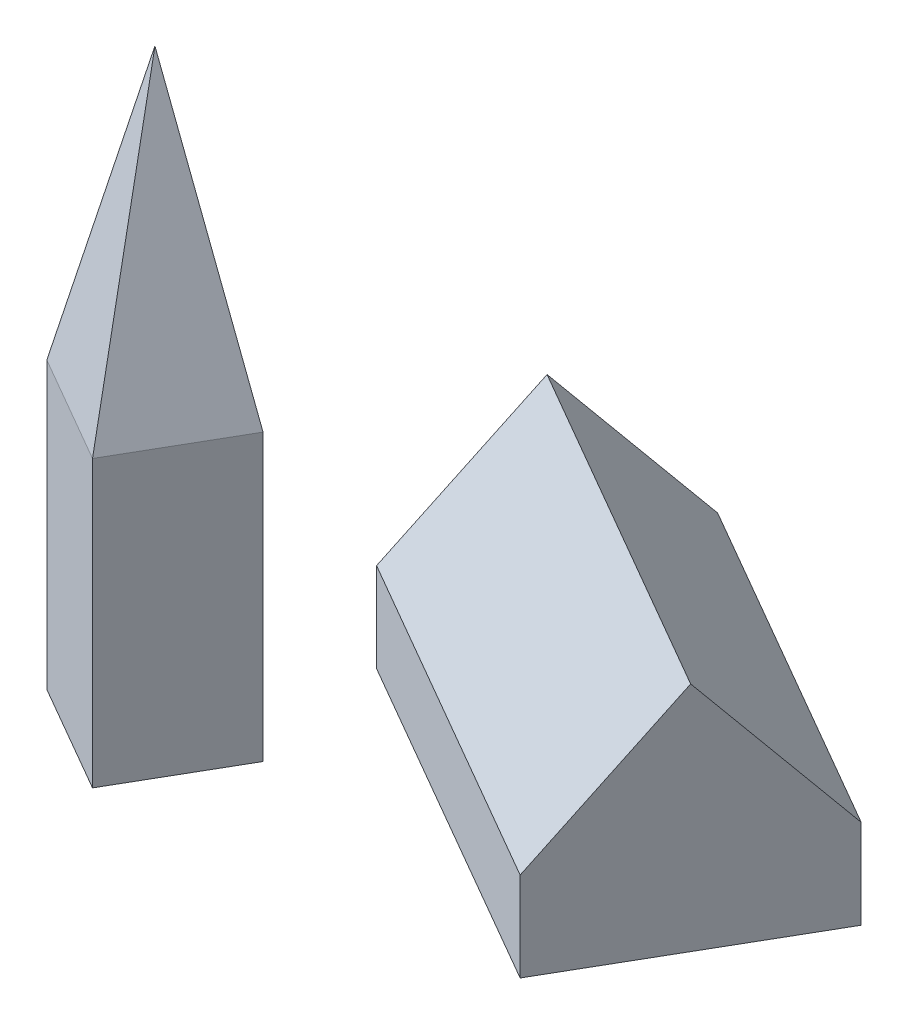
ISO-10303-21;
HEADER;
FILE_DESCRIPTION(('STEP AP214'),'2;1');
FILE_NAME('part.step','',(''),(''),'','','');
FILE_SCHEMA(('AUTOMOTIVE_DESIGN { 1 0 10303 214 1 1 1 1 }'));
ENDSEC;
DATA;
#1=APPLICATION_CONTEXT('core data for automotive mechanical design processes');
#2=APPLICATION_PROTOCOL_DEFINITION('international standard','automotive_design',2000,#1);
#3=PRODUCT_CONTEXT('',#1,'mechanical');
#4=PRODUCT('Part','Part','',(#3));
#5=PRODUCT_RELATED_PRODUCT_CATEGORY('part','',(#4));
#6=PRODUCT_DEFINITION_FORMATION('','',#4);
#7=PRODUCT_DEFINITION_CONTEXT('part definition',#1,'design');
#8=PRODUCT_DEFINITION('design','',#6,#7);
#9=PRODUCT_DEFINITION_SHAPE('','',#8);
#10=(LENGTH_UNIT() NAMED_UNIT(*) SI_UNIT(.MILLI.,.METRE.));
#11=(NAMED_UNIT(*) PLANE_ANGLE_UNIT() SI_UNIT($,.RADIAN.));
#12=(NAMED_UNIT(*) SI_UNIT($,.STERADIAN.) SOLID_ANGLE_UNIT());
#13=UNCERTAINTY_MEASURE_WITH_UNIT(LENGTH_MEASURE(1.E-05),#10,'distance_accuracy_value','');
#14=(GEOMETRIC_REPRESENTATION_CONTEXT(3) GLOBAL_UNCERTAINTY_ASSIGNED_CONTEXT((#13)) GLOBAL_UNIT_ASSIGNED_CONTEXT((#10,
#11,#12)) REPRESENTATION_CONTEXT('',''));
#15=CARTESIAN_POINT('',(0.,0.,0.));
#16=DIRECTION('',(0.,0.,1.));
#17=DIRECTION('',(1.,0.,0.));
#18=AXIS2_PLACEMENT_3D('',#15,#16,#17);
#19=CARTESIAN_POINT('',(-76.1602540378445,80.,111.913429510899));
#20=DIRECTION('',(0.866025403784439,0.,0.5));
#21=DIRECTION('',(0.5,0.,-0.866025403784439));
#22=AXIS2_PLACEMENT_3D('',#19,#20,#21);
#23=PLANE('',#22);
#24=DIRECTION('',(-0.5,0.,0.866025403784439));
#25=VECTOR('',#24,1.);
#26=CARTESIAN_POINT('',(-76.1602540378445,0.,111.913429510899));
#27=LINE('',#26,#25);
#28=CARTESIAN_POINT('',(-58.6602540378445,0.,81.6025403784438));
#29=VERTEX_POINT('',#28);
#30=CARTESIAN_POINT('',(-76.1602540378445,0.,111.913429510899));
#31=VERTEX_POINT('',#30);
#32=EDGE_CURVE('E121',#29,#31,#27,.T.);
#33=ORIENTED_EDGE('',*,*,#32,.T.);
#34=DIRECTION('',(0.,-1.,0.));
#35=VECTOR('',#34,1.);
#36=CARTESIAN_POINT('',(-76.1602540378445,80.,111.913429510899));
#37=LINE('',#36,#35);
#38=CARTESIAN_POINT('',(-76.1602540378445,80.,111.913429510899));
#39=VERTEX_POINT('',#38);
#40=EDGE_CURVE('E13',#39,#31,#37,.T.);
#41=ORIENTED_EDGE('',*,*,#40,.F.);
#42=DIRECTION('',(-0.5,0.,0.866025403784439));
#43=VECTOR('',#42,1.);
#44=CARTESIAN_POINT('',(-58.6602540378445,80.,81.6025403784438));
#45=LINE('',#44,#43);
#46=CARTESIAN_POINT('',(-58.6602540378445,80.0000000000001,81.6025403784438));
#47=VERTEX_POINT('',#46);
#48=EDGE_CURVE('E99',#47,#39,#45,.T.);
#49=ORIENTED_EDGE('',*,*,#48,.F.);
#50=DIRECTION('',(0.,-1.,0.));
#51=VECTOR('',#50,1.);
#52=CARTESIAN_POINT('',(-58.6602540378445,80.,81.6025403784438));
#53=LINE('',#52,#51);
#54=EDGE_CURVE('E101',#47,#29,#53,.T.);
#55=ORIENTED_EDGE('',*,*,#54,.T.);
#56=EDGE_LOOP('',(#33,#41,#49,#55));
#57=FACE_BOUND('',#56,.T.);
#58=ADVANCED_FACE('F44',(#57),#23,.F.);
#59=CARTESIAN_POINT('',(-45.8493649053892,80.,129.413429510899));
#60=DIRECTION('',(0.499999999999999,0.,-0.866025403784439));
#61=DIRECTION('',(-0.866025403784439,0.,-0.499999999999999));
#62=AXIS2_PLACEMENT_3D('',#59,#60,#61);
#63=PLANE('',#62);
#64=DIRECTION('',(0.866025403784439,0.,0.499999999999999));
#65=VECTOR('',#64,1.);
#66=CARTESIAN_POINT('',(-45.8493649053892,0.,129.413429510899));
#67=LINE('',#66,#65);
#68=CARTESIAN_POINT('',(-45.8493649053892,0.,129.413429510899));
#69=VERTEX_POINT('',#68);
#70=EDGE_CURVE('E128',#31,#69,#67,.T.);
#71=ORIENTED_EDGE('',*,*,#70,.T.);
#72=DIRECTION('',(0.,-1.,0.));
#73=VECTOR('',#72,1.);
#74=CARTESIAN_POINT('',(-45.8493649053892,80.,129.413429510899));
#75=LINE('',#74,#73);
#76=CARTESIAN_POINT('',(-45.8493649053892,80.0000000000001,129.413429510899));
#77=VERTEX_POINT('',#76);
#78=EDGE_CURVE('E53',#77,#69,#75,.T.);
#79=ORIENTED_EDGE('',*,*,#78,.F.);
#80=DIRECTION('',(0.866025403784439,0.,0.499999999999999));
#81=VECTOR('',#80,1.);
#82=CARTESIAN_POINT('',(-76.1602540378445,80.,111.913429510899));
#83=LINE('',#82,#81);
#84=EDGE_CURVE('E47',#39,#77,#83,.T.);
#85=ORIENTED_EDGE('',*,*,#84,.F.);
#86=ORIENTED_EDGE('',*,*,#40,.T.);
#87=EDGE_LOOP('',(#71,#79,#85,#86));
#88=FACE_BOUND('',#87,.T.);
#89=ADVANCED_FACE('F149',(#88),#63,.F.);
#90=CARTESIAN_POINT('',(-28.3493649053892,80.,99.1025403784438));
#91=DIRECTION('',(-0.866025403784439,0.,-0.5));
#92=DIRECTION('',(-0.5,0.,0.866025403784439));
#93=AXIS2_PLACEMENT_3D('',#90,#91,#92);
#94=PLANE('',#93);
#95=DIRECTION('',(0.5,0.,-0.866025403784439));
#96=VECTOR('',#95,1.);
#97=CARTESIAN_POINT('',(-28.3493649053892,0.,99.1025403784438));
#98=LINE('',#97,#96);
#99=CARTESIAN_POINT('',(-28.3493649053892,0.,99.1025403784438));
#100=VERTEX_POINT('',#99);
#101=EDGE_CURVE('E130',#69,#100,#98,.T.);
#102=ORIENTED_EDGE('',*,*,#101,.T.);
#103=DIRECTION('',(0.,-1.,0.));
#104=VECTOR('',#103,1.);
#105=CARTESIAN_POINT('',(-28.3493649053892,80.,99.1025403784438));
#106=LINE('',#105,#104);
#107=CARTESIAN_POINT('',(-28.3493649053892,80.0000000000002,99.1025403784438));
#108=VERTEX_POINT('',#107);
#109=EDGE_CURVE('E61',#108,#100,#106,.T.);
#110=ORIENTED_EDGE('',*,*,#109,.F.);
#111=DIRECTION('',(0.5,0.,-0.866025403784439));
#112=VECTOR('',#111,1.);
#113=CARTESIAN_POINT('',(-45.8493649053892,80.,129.413429510899));
#114=LINE('',#113,#112);
#115=EDGE_CURVE('E115',#77,#108,#114,.T.);
#116=ORIENTED_EDGE('',*,*,#115,.F.);
#117=ORIENTED_EDGE('',*,*,#78,.T.);
#118=EDGE_LOOP('',(#102,#110,#116,#117));
#119=FACE_BOUND('',#118,.T.);
#120=ADVANCED_FACE('F153',(#119),#94,.F.);
#121=CARTESIAN_POINT('',(-58.6602540378445,80.,81.6025403784438));
#122=DIRECTION('',(-0.5,0.,0.866025403784438));
#123=DIRECTION('',(0.866025403784438,0.,0.5));
#124=AXIS2_PLACEMENT_3D('',#121,#122,#123);
#125=PLANE('',#124);
#126=DIRECTION('',(-0.866025403784438,0.,-0.5));
#127=VECTOR('',#126,1.);
#128=CARTESIAN_POINT('',(-58.6602540378445,0.,81.6025403784438));
#129=LINE('',#128,#127);
#130=EDGE_CURVE('E78',#100,#29,#129,.T.);
#131=ORIENTED_EDGE('',*,*,#130,.T.);
#132=ORIENTED_EDGE('',*,*,#54,.F.);
#133=DIRECTION('',(-0.866025403784438,0.,-0.5));
#134=VECTOR('',#133,1.);
#135=CARTESIAN_POINT('',(-28.3493649053892,80.,99.1025403784438));
#136=LINE('',#135,#134);
#137=EDGE_CURVE('E110',#108,#47,#136,.T.);
#138=ORIENTED_EDGE('',*,*,#137,.F.);
#139=ORIENTED_EDGE('',*,*,#109,.T.);
#140=EDGE_LOOP('',(#131,#132,#138,#139));
#141=FACE_BOUND('',#140,.T.);
#142=ADVANCED_FACE('F109',(#141),#125,.F.);
#143=CARTESIAN_POINT('',(-58.6602540378445,0.,81.6025403784438));
#144=DIRECTION('',(0.,-1.,0.));
#145=DIRECTION('',(0.,0.,-1.));
#146=AXIS2_PLACEMENT_3D('',#143,#144,#145);
#147=PLANE('',#146);
#148=ORIENTED_EDGE('',*,*,#32,.F.);
#149=ORIENTED_EDGE('',*,*,#130,.F.);
#150=ORIENTED_EDGE('',*,*,#101,.F.);
#151=ORIENTED_EDGE('',*,*,#70,.F.);
#152=EDGE_LOOP('',(#148,#149,#150,#151));
#153=FACE_BOUND('',#152,.T.);
#154=ADVANCED_FACE('F140',(#153),#147,.T.);
#155=CARTESIAN_POINT('',(-58.6602540378445,80.,81.6025403784438));
#156=DIRECTION('',(-0.848234681375854,0.201652920670487,-0.489728521628326));
#157=DIRECTION('',(-0.5,0.,0.866025403784439));
#158=AXIS2_PLACEMENT_3D('',#155,#156,#157);
#159=PLANE('',#158);
#160=DIRECTION('',(-0.0723536592387232,-0.960130241032339,-0.27002753239244));
#161=VECTOR('',#160,1.);
#162=CARTESIAN_POINT('',(-52.2548094716168,165.,105.507984944671));
#163=LINE('',#162,#161);
#164=CARTESIAN_POINT('',(-52.2548094716168,165.,105.507984944671));
#165=VERTEX_POINT('',#164);
#166=EDGE_CURVE('E114',#165,#47,#163,.T.);
#167=ORIENTED_EDGE('',*,*,#166,.T.);
#168=ORIENTED_EDGE('',*,*,#48,.T.);
#169=DIRECTION('',(-0.27002753239244,-0.960130241032339,0.0723536592387233));
#170=VECTOR('',#169,1.);
#171=CARTESIAN_POINT('',(-52.2548094716168,165.,105.507984944671));
#172=LINE('',#171,#170);
#173=EDGE_CURVE('E118',#165,#39,#172,.T.);
#174=ORIENTED_EDGE('',*,*,#173,.F.);
#175=EDGE_LOOP('',(#167,#168,#174));
#176=FACE_BOUND('',#175,.T.);
#177=ADVANCED_FACE('F117',(#176),#159,.T.);
#178=CARTESIAN_POINT('',(-76.1602540378445,80.,111.913429510899));
#179=DIRECTION('',(-0.489728521628325,0.201652920670487,0.848234681375855));
#180=DIRECTION('',(0.866025403784439,0.,0.499999999999999));
#181=AXIS2_PLACEMENT_3D('',#178,#179,#180);
#182=PLANE('',#181);
#183=ORIENTED_EDGE('',*,*,#173,.T.);
#184=ORIENTED_EDGE('',*,*,#84,.T.);
#185=DIRECTION('',(0.0723536592387231,-0.960130241032339,0.27002753239244));
#186=VECTOR('',#185,1.);
#187=CARTESIAN_POINT('',(-52.2548094716168,165.,105.507984944671));
#188=LINE('',#187,#186);
#189=EDGE_CURVE('E123',#165,#77,#188,.T.);
#190=ORIENTED_EDGE('',*,*,#189,.F.);
#191=EDGE_LOOP('',(#183,#184,#190));
#192=FACE_BOUND('',#191,.T.);
#193=ADVANCED_FACE('F136',(#192),#182,.T.);
#194=CARTESIAN_POINT('',(-28.3493649053892,80.,99.1025403784438));
#195=DIRECTION('',(0.489728521628326,0.201652920670487,-0.848234681375854));
#196=DIRECTION('',(-0.866025403784438,0.,-0.5));
#197=AXIS2_PLACEMENT_3D('',#194,#195,#196);
#198=PLANE('',#197);
#199=DIRECTION('',(0.27002753239244,-0.960130241032339,-0.0723536592387227));
#200=VECTOR('',#199,1.);
#201=CARTESIAN_POINT('',(-52.2548094716168,165.,105.507984944671));
#202=LINE('',#201,#200);
#203=EDGE_CURVE('E94',#165,#108,#202,.T.);
#204=ORIENTED_EDGE('',*,*,#203,.T.);
#205=ORIENTED_EDGE('',*,*,#137,.T.);
#206=ORIENTED_EDGE('',*,*,#166,.F.);
#207=EDGE_LOOP('',(#204,#205,#206));
#208=FACE_BOUND('',#207,.T.);
#209=ADVANCED_FACE('F113',(#208),#198,.T.);
#210=CARTESIAN_POINT('',(-45.8493649053892,80.,129.413429510899));
#211=DIRECTION('',(0.848234681375854,0.201652920670487,0.489728521628326));
#212=DIRECTION('',(0.5,0.,-0.866025403784439));
#213=AXIS2_PLACEMENT_3D('',#210,#211,#212);
#214=PLANE('',#213);
#215=ORIENTED_EDGE('',*,*,#189,.T.);
#216=ORIENTED_EDGE('',*,*,#115,.T.);
#217=ORIENTED_EDGE('',*,*,#203,.F.);
#218=EDGE_LOOP('',(#215,#216,#217));
#219=FACE_BOUND('',#218,.T.);
#220=ADVANCED_FACE('F137',(#219),#214,.T.);
#221=CLOSED_SHELL('',(#58,#89,#120,#142,#154,#177,#193,#209,#220));
#222=MANIFOLD_SOLID_BREP('B2',#221);
#223=CARTESIAN_POINT('',(-35.0000000000003,25.,60.6217782649106));
#224=DIRECTION('',(0.866025403784436,0.,0.500000000000004));
#225=DIRECTION('',(0.500000000000004,0.,-0.866025403784436));
#226=AXIS2_PLACEMENT_3D('',#223,#224,#225);
#227=PLANE('',#226);
#228=DIRECTION('',(-0.500000000000004,0.,0.866025403784436));
#229=VECTOR('',#228,1.);
#230=CARTESIAN_POINT('',(-35.0000000000003,0.,60.6217782649106));
#231=LINE('',#230,#229);
#232=CARTESIAN_POINT('',(0.,0.,0.));
#233=VERTEX_POINT('',#232);
#234=CARTESIAN_POINT('',(-35.0000000000003,0.,60.6217782649106));
#235=VERTEX_POINT('',#234);
#236=EDGE_CURVE('E271',#233,#235,#231,.T.);
#237=ORIENTED_EDGE('',*,*,#236,.T.);
#238=DIRECTION('',(0.,-1.,0.));
#239=VECTOR('',#238,1.);
#240=CARTESIAN_POINT('',(-35.0000000000003,25.,60.6217782649106));
#241=LINE('',#240,#239);
#242=CARTESIAN_POINT('',(-35.0000000000003,25.,60.6217782649106));
#243=VERTEX_POINT('',#242);
#244=EDGE_CURVE('E42',#243,#235,#241,.T.);
#245=ORIENTED_EDGE('',*,*,#244,.F.);
#246=DIRECTION('',(-0.329252303934262,-0.752576694706878,0.570281718923245));
#247=VECTOR('',#246,1.);
#248=CARTESIAN_POINT('',(-17.5000000000001,65.,30.3108891324553));
#249=LINE('',#248,#247);
#250=CARTESIAN_POINT('',(-17.5000000000001,65.,30.3108891324553));
#251=VERTEX_POINT('',#250);
#252=EDGE_CURVE('E279',#251,#243,#249,.T.);
#253=ORIENTED_EDGE('',*,*,#252,.F.);
#254=DIRECTION('',(-0.329252303934261,0.752576694706878,0.570281718923245));
#255=VECTOR('',#254,1.);
#256=CARTESIAN_POINT('',(0.,25.,0.));
#257=LINE('',#256,#255);
#258=CARTESIAN_POINT('',(0.,25.,0.));
#259=VERTEX_POINT('',#258);
#260=EDGE_CURVE('E267',#259,#251,#257,.T.);
#261=ORIENTED_EDGE('',*,*,#260,.F.);
#262=DIRECTION('',(0.,-1.,0.));
#263=VECTOR('',#262,1.);
#264=CARTESIAN_POINT('',(0.,25.,0.));
#265=LINE('',#264,#263);
#266=EDGE_CURVE('E295',#259,#233,#265,.T.);
#267=ORIENTED_EDGE('',*,*,#266,.T.);
#268=EDGE_LOOP('',(#237,#245,#253,#261,#267));
#269=FACE_BOUND('',#268,.T.);
#270=ADVANCED_FACE('F215',(#269),#227,.F.);
#271=CARTESIAN_POINT('',(60.2627944162877,25.,115.621778264911));
#272=DIRECTION('',(0.500000000000004,0.,-0.866025403784436));
#273=DIRECTION('',(-0.866025403784436,0.,-0.500000000000004));
#274=AXIS2_PLACEMENT_3D('',#271,#272,#273);
#275=PLANE('',#274);
#276=DIRECTION('',(0.866025403784436,0.,0.500000000000004));
#277=VECTOR('',#276,1.);
#278=CARTESIAN_POINT('',(60.2627944162877,0.,115.621778264911));
#279=LINE('',#278,#277);
#280=CARTESIAN_POINT('',(60.2627944162877,0.,115.621778264911));
#281=VERTEX_POINT('',#280);
#282=EDGE_CURVE('E286',#235,#281,#279,.T.);
#283=ORIENTED_EDGE('',*,*,#282,.T.);
#284=DIRECTION('',(0.,-1.,0.));
#285=VECTOR('',#284,1.);
#286=CARTESIAN_POINT('',(60.2627944162877,25.,115.621778264911));
#287=LINE('',#286,#285);
#288=CARTESIAN_POINT('',(60.2627944162877,25.,115.621778264911));
#289=VERTEX_POINT('',#288);
#290=EDGE_CURVE('E222',#289,#281,#287,.T.);
#291=ORIENTED_EDGE('',*,*,#290,.F.);
#292=DIRECTION('',(0.866025403784436,0.,0.500000000000004));
#293=VECTOR('',#292,1.);
#294=CARTESIAN_POINT('',(60.2627944162877,25.,115.621778264911));
#295=LINE('',#294,#293);
#296=EDGE_CURVE('E276',#243,#289,#295,.T.);
#297=ORIENTED_EDGE('',*,*,#296,.F.);
#298=ORIENTED_EDGE('',*,*,#244,.T.);
#299=EDGE_LOOP('',(#283,#291,#297,#298));
#300=FACE_BOUND('',#299,.T.);
#301=ADVANCED_FACE('F307',(#300),#275,.F.);
#302=CARTESIAN_POINT('',(95.262794416288,25.,55.0000000000004));
#303=DIRECTION('',(-0.866025403784436,0.,-0.500000000000004));
#304=DIRECTION('',(-0.500000000000004,0.,0.866025403784436));
#305=AXIS2_PLACEMENT_3D('',#302,#303,#304);
#306=PLANE('',#305);
#307=DIRECTION('',(0.500000000000004,0.,-0.866025403784436));
#308=VECTOR('',#307,1.);
#309=CARTESIAN_POINT('',(95.262794416288,0.,55.0000000000004));
#310=LINE('',#309,#308);
#311=CARTESIAN_POINT('',(95.262794416288,0.,55.0000000000004));
#312=VERTEX_POINT('',#311);
#313=EDGE_CURVE('E288',#281,#312,#310,.T.);
#314=ORIENTED_EDGE('',*,*,#313,.T.);
#315=DIRECTION('',(0.,-1.,0.));
#316=VECTOR('',#315,1.);
#317=CARTESIAN_POINT('',(95.262794416288,25.,55.0000000000004));
#318=LINE('',#317,#316);
#319=CARTESIAN_POINT('',(95.262794416288,25.,55.0000000000004));
#320=VERTEX_POINT('',#319);
#321=EDGE_CURVE('E229',#320,#312,#318,.T.);
#322=ORIENTED_EDGE('',*,*,#321,.F.);
#323=DIRECTION('',(-0.329252303934261,0.752576694706878,0.570281718923245));
#324=VECTOR('',#323,1.);
#325=CARTESIAN_POINT('',(95.262794416288,25.,55.0000000000004));
#326=LINE('',#325,#324);
#327=CARTESIAN_POINT('',(77.7627944162879,65.,85.3108891324557));
#328=VERTEX_POINT('',#327);
#329=EDGE_CURVE('E265',#320,#328,#326,.T.);
#330=ORIENTED_EDGE('',*,*,#329,.T.);
#331=DIRECTION('',(-0.329252303934262,-0.752576694706878,0.570281718923245));
#332=VECTOR('',#331,1.);
#333=CARTESIAN_POINT('',(77.7627944162879,65.,85.3108891324557));
#334=LINE('',#333,#332);
#335=EDGE_CURVE('E274',#328,#289,#334,.T.);
#336=ORIENTED_EDGE('',*,*,#335,.T.);
#337=ORIENTED_EDGE('',*,*,#290,.T.);
#338=EDGE_LOOP('',(#314,#322,#330,#336,#337));
#339=FACE_BOUND('',#338,.T.);
#340=ADVANCED_FACE('F278',(#339),#306,.F.);
#341=CARTESIAN_POINT('',(0.,25.,0.));
#342=DIRECTION('',(-0.500000000000004,0.,0.866025403784436));
#343=DIRECTION('',(0.866025403784436,0.,0.500000000000004));
#344=AXIS2_PLACEMENT_3D('',#341,#342,#343);
#345=PLANE('',#344);
#346=DIRECTION('',(-0.866025403784436,0.,-0.500000000000004));
#347=VECTOR('',#346,1.);
#348=CARTESIAN_POINT('',(0.,0.,0.));
#349=LINE('',#348,#347);
#350=EDGE_CURVE('E290',#312,#233,#349,.T.);
#351=ORIENTED_EDGE('',*,*,#350,.T.);
#352=ORIENTED_EDGE('',*,*,#266,.F.);
#353=DIRECTION('',(-0.866025403784436,0.,-0.500000000000004));
#354=VECTOR('',#353,1.);
#355=CARTESIAN_POINT('',(0.,25.,0.));
#356=LINE('',#355,#354);
#357=EDGE_CURVE('E293',#320,#259,#356,.T.);
#358=ORIENTED_EDGE('',*,*,#357,.F.);
#359=ORIENTED_EDGE('',*,*,#321,.T.);
#360=EDGE_LOOP('',(#351,#352,#358,#359));
#361=FACE_BOUND('',#360,.T.);
#362=ADVANCED_FACE('F304',(#361),#345,.F.);
#363=CARTESIAN_POINT('',(-35.0000000000003,0.,60.6217782649106));
#364=DIRECTION('',(0.,1.,0.));
#365=DIRECTION('',(0.,0.,1.));
#366=AXIS2_PLACEMENT_3D('',#363,#364,#365);
#367=PLANE('',#366);
#368=ORIENTED_EDGE('',*,*,#236,.F.);
#369=ORIENTED_EDGE('',*,*,#350,.F.);
#370=ORIENTED_EDGE('',*,*,#313,.F.);
#371=ORIENTED_EDGE('',*,*,#282,.F.);
#372=EDGE_LOOP('',(#368,#369,#370,#371));
#373=FACE_BOUND('',#372,.T.);
#374=ADVANCED_FACE('F302',(#373),#367,.F.);
#375=CARTESIAN_POINT('',(-17.5000000000001,65.,30.3108891324553));
#376=DIRECTION('',(-0.376288347353442,0.658504607868518,0.65175053591228));
#377=DIRECTION('',(0.,-0.703452458112658,0.710742315593534));
#378=AXIS2_PLACEMENT_3D('',#375,#376,#377);
#379=PLANE('',#378);
#380=ORIENTED_EDGE('',*,*,#335,.F.);
#381=DIRECTION('',(0.866025403784437,0.,0.500000000000004));
#382=VECTOR('',#381,1.);
#383=CARTESIAN_POINT('',(-17.5000000000001,65.,30.3108891324553));
#384=LINE('',#383,#382);
#385=EDGE_CURVE('E261',#251,#328,#384,.T.);
#386=ORIENTED_EDGE('',*,*,#385,.F.);
#387=ORIENTED_EDGE('',*,*,#252,.T.);
#388=ORIENTED_EDGE('',*,*,#296,.T.);
#389=EDGE_LOOP('',(#380,#386,#387,#388));
#390=FACE_BOUND('',#389,.T.);
#391=ADVANCED_FACE('F275',(#390),#379,.T.);
#392=CARTESIAN_POINT('',(0.,25.,0.));
#393=DIRECTION('',(0.376288347353442,0.658504607868518,-0.65175053591228));
#394=DIRECTION('',(0.,0.703452458112658,0.710742315593534));
#395=AXIS2_PLACEMENT_3D('',#392,#393,#394);
#396=PLANE('',#395);
#397=ORIENTED_EDGE('',*,*,#329,.F.);
#398=ORIENTED_EDGE('',*,*,#357,.T.);
#399=ORIENTED_EDGE('',*,*,#260,.T.);
#400=ORIENTED_EDGE('',*,*,#385,.T.);
#401=EDGE_LOOP('',(#397,#398,#399,#400));
#402=FACE_BOUND('',#401,.T.);
#403=ADVANCED_FACE('F263',(#402),#396,.T.);
#404=CLOSED_SHELL('',(#270,#301,#340,#362,#374,#391,#403));
#405=MANIFOLD_SOLID_BREP('B7',#404);
#406=ADVANCED_BREP_SHAPE_REPRESENTATION('',(#18,#222,#405),#14);
#407=SHAPE_DEFINITION_REPRESENTATION(#9,#406);
ENDSEC;
END-ISO-10303-21;
